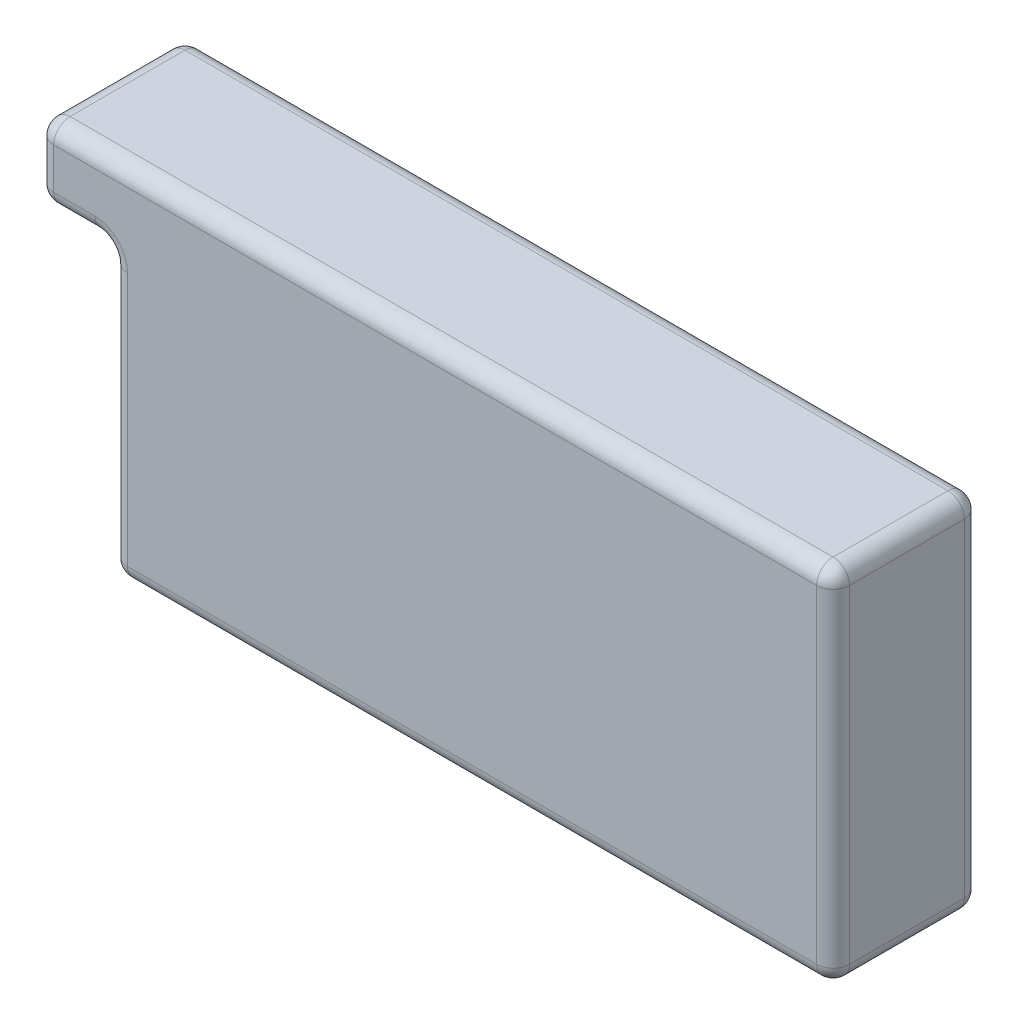
ISO-10303-21;
HEADER;
FILE_DESCRIPTION(('STEP AP214'),'2;1');
FILE_NAME('part.step','',(''),(''),'','','');
FILE_SCHEMA(('AUTOMOTIVE_DESIGN { 1 0 10303 214 1 1 1 1 }'));
ENDSEC;
DATA;
#1=APPLICATION_CONTEXT('core data for automotive mechanical design processes');
#2=APPLICATION_PROTOCOL_DEFINITION('international standard','automotive_design',2000,#1);
#3=PRODUCT_CONTEXT('',#1,'mechanical');
#4=PRODUCT('Part','Part','',(#3));
#5=PRODUCT_RELATED_PRODUCT_CATEGORY('part','',(#4));
#6=PRODUCT_DEFINITION_FORMATION('','',#4);
#7=PRODUCT_DEFINITION_CONTEXT('part definition',#1,'design');
#8=PRODUCT_DEFINITION('design','',#6,#7);
#9=PRODUCT_DEFINITION_SHAPE('','',#8);
#10=(LENGTH_UNIT() NAMED_UNIT(*) SI_UNIT(.MILLI.,.METRE.));
#11=(NAMED_UNIT(*) PLANE_ANGLE_UNIT() SI_UNIT($,.RADIAN.));
#12=(NAMED_UNIT(*) SI_UNIT($,.STERADIAN.) SOLID_ANGLE_UNIT());
#13=UNCERTAINTY_MEASURE_WITH_UNIT(LENGTH_MEASURE(1.E-05),#10,'distance_accuracy_value','');
#14=(GEOMETRIC_REPRESENTATION_CONTEXT(3) GLOBAL_UNCERTAINTY_ASSIGNED_CONTEXT((#13)) GLOBAL_UNIT_ASSIGNED_CONTEXT((#10,
#11,#12)) REPRESENTATION_CONTEXT('',''));
#15=CARTESIAN_POINT('',(0.,0.,0.));
#16=DIRECTION('',(0.,0.,1.));
#17=DIRECTION('',(1.,0.,0.));
#18=AXIS2_PLACEMENT_3D('',#15,#16,#17);
#19=CARTESIAN_POINT('',(0.,0.,9.));
#20=DIRECTION('',(1.,0.,0.));
#21=DIRECTION('',(0.,0.,-1.));
#22=AXIS2_PLACEMENT_3D('',#19,#20,#21);
#23=PLANE('',#22);
#24=DIRECTION('',(0.,-1.,0.));
#25=VECTOR('',#24,1.);
#26=CARTESIAN_POINT('',(0.,0.,0.999999999999999));
#27=LINE('',#26,#25);
#28=CARTESIAN_POINT('',(0.,-5.5,0.999999999999999));
#29=VERTEX_POINT('',#28);
#30=CARTESIAN_POINT('',(0.,-21.,0.999999999999999));
#31=VERTEX_POINT('',#30);
#32=EDGE_CURVE('E256',#29,#31,#27,.T.);
#33=ORIENTED_EDGE('',*,*,#32,.T.);
#34=DIRECTION('',(0.,0.,-1.));
#35=VECTOR('',#34,1.);
#36=CARTESIAN_POINT('',(0.,-21.,9.));
#37=LINE('',#36,#35);
#38=CARTESIAN_POINT('',(0.,-21.,8.));
#39=VERTEX_POINT('',#38);
#40=EDGE_CURVE('E258',#31,#39,#37,.F.);
#41=ORIENTED_EDGE('',*,*,#40,.T.);
#42=DIRECTION('',(0.,-1.,0.));
#43=VECTOR('',#42,1.);
#44=CARTESIAN_POINT('',(0.,-4.5,8.));
#45=LINE('',#44,#43);
#46=CARTESIAN_POINT('',(0.,-5.5,8.));
#47=VERTEX_POINT('',#46);
#48=EDGE_CURVE('E252',#39,#47,#45,.F.);
#49=ORIENTED_EDGE('',*,*,#48,.T.);
#50=DIRECTION('',(0.,0.,-1.));
#51=VECTOR('',#50,1.);
#52=CARTESIAN_POINT('',(0.,-5.5,9.));
#53=LINE('',#52,#51);
#54=EDGE_CURVE('E254',#47,#29,#53,.T.);
#55=ORIENTED_EDGE('',*,*,#54,.T.);
#56=EDGE_LOOP('',(#33,#41,#49,#55));
#57=FACE_BOUND('',#56,.T.);
#58=ADVANCED_FACE('F34',(#57),#23,.F.);
#59=CARTESIAN_POINT('',(0.,-22.,9.));
#60=DIRECTION('',(0.,1.,0.));
#61=DIRECTION('',(0.,0.,1.));
#62=AXIS2_PLACEMENT_3D('',#59,#60,#61);
#63=PLANE('',#62);
#64=DIRECTION('',(1.,0.,0.));
#65=VECTOR('',#64,1.);
#66=CARTESIAN_POINT('',(0.,-22.,0.999999999999999));
#67=LINE('',#66,#65);
#68=CARTESIAN_POINT('',(1.,-22.,0.999999999999999));
#69=VERTEX_POINT('',#68);
#70=CARTESIAN_POINT('',(43.,-22.,0.999999999999999));
#71=VERTEX_POINT('',#70);
#72=EDGE_CURVE('E222',#69,#71,#67,.T.);
#73=ORIENTED_EDGE('',*,*,#72,.T.);
#74=DIRECTION('',(0.,0.,-1.));
#75=VECTOR('',#74,1.);
#76=CARTESIAN_POINT('',(43.,-22.,9.));
#77=LINE('',#76,#75);
#78=CARTESIAN_POINT('',(43.,-22.,8.));
#79=VERTEX_POINT('',#78);
#80=EDGE_CURVE('E224',#71,#79,#77,.F.);
#81=ORIENTED_EDGE('',*,*,#80,.T.);
#82=DIRECTION('',(1.,0.,0.));
#83=VECTOR('',#82,1.);
#84=CARTESIAN_POINT('',(0.,-22.,8.));
#85=LINE('',#84,#83);
#86=CARTESIAN_POINT('',(1.,-22.,8.));
#87=VERTEX_POINT('',#86);
#88=EDGE_CURVE('E218',#79,#87,#85,.F.);
#89=ORIENTED_EDGE('',*,*,#88,.T.);
#90=DIRECTION('',(0.,0.,-1.));
#91=VECTOR('',#90,1.);
#92=CARTESIAN_POINT('',(1.,-22.,9.));
#93=LINE('',#92,#91);
#94=EDGE_CURVE('E220',#87,#69,#93,.T.);
#95=ORIENTED_EDGE('',*,*,#94,.T.);
#96=EDGE_LOOP('',(#73,#81,#89,#95));
#97=FACE_BOUND('',#96,.T.);
#98=ADVANCED_FACE('F419',(#97),#63,.F.);
#99=CARTESIAN_POINT('',(44.,0.,9.));
#100=DIRECTION('',(-1.,0.,0.));
#101=DIRECTION('',(0.,0.,1.));
#102=AXIS2_PLACEMENT_3D('',#99,#100,#101);
#103=PLANE('',#102);
#104=DIRECTION('',(0.,0.,-1.));
#105=VECTOR('',#104,1.);
#106=CARTESIAN_POINT('',(44.,-21.,9.));
#107=LINE('',#106,#105);
#108=CARTESIAN_POINT('',(44.,-21.,8.));
#109=VERTEX_POINT('',#108);
#110=CARTESIAN_POINT('',(44.,-21.,0.999999999999999));
#111=VERTEX_POINT('',#110);
#112=EDGE_CURVE('E213',#109,#111,#107,.T.);
#113=ORIENTED_EDGE('',*,*,#112,.T.);
#114=DIRECTION('',(0.,1.,0.));
#115=VECTOR('',#114,1.);
#116=CARTESIAN_POINT('',(44.,0.,0.999999999999999));
#117=LINE('',#116,#115);
#118=CARTESIAN_POINT('',(44.,-1.,0.999999999999999));
#119=VERTEX_POINT('',#118);
#120=EDGE_CURVE('E216',#111,#119,#117,.T.);
#121=ORIENTED_EDGE('',*,*,#120,.T.);
#122=DIRECTION('',(0.,0.,-1.));
#123=VECTOR('',#122,1.);
#124=CARTESIAN_POINT('',(44.,-1.,9.));
#125=LINE('',#124,#123);
#126=CARTESIAN_POINT('',(44.,-1.,8.));
#127=VERTEX_POINT('',#126);
#128=EDGE_CURVE('E211',#119,#127,#125,.F.);
#129=ORIENTED_EDGE('',*,*,#128,.T.);
#130=DIRECTION('',(0.,1.,0.));
#131=VECTOR('',#130,1.);
#132=CARTESIAN_POINT('',(44.,-22.,8.));
#133=LINE('',#132,#131);
#134=EDGE_CURVE('E209',#127,#109,#133,.F.);
#135=ORIENTED_EDGE('',*,*,#134,.T.);
#136=EDGE_LOOP('',(#113,#121,#129,#135));
#137=FACE_BOUND('',#136,.T.);
#138=ADVANCED_FACE('F391',(#137),#103,.F.);
#139=CARTESIAN_POINT('',(0.,0.,9.));
#140=DIRECTION('',(0.,-1.,0.));
#141=DIRECTION('',(0.,0.,-1.));
#142=AXIS2_PLACEMENT_3D('',#139,#140,#141);
#143=PLANE('',#142);
#144=DIRECTION('',(0.,0.,-1.));
#145=VECTOR('',#144,1.);
#146=CARTESIAN_POINT('',(43.,0.,9.));
#147=LINE('',#146,#145);
#148=CARTESIAN_POINT('',(43.,0.,8.));
#149=VERTEX_POINT('',#148);
#150=CARTESIAN_POINT('',(43.,0.,0.999999999999999));
#151=VERTEX_POINT('',#150);
#152=EDGE_CURVE('E231',#149,#151,#147,.T.);
#153=ORIENTED_EDGE('',*,*,#152,.T.);
#154=DIRECTION('',(-1.,0.,0.));
#155=VECTOR('',#154,1.);
#156=CARTESIAN_POINT('',(0.,0.,0.999999999999999));
#157=LINE('',#156,#155);
#158=CARTESIAN_POINT('',(-3.5,0.,0.999999999999999));
#159=VERTEX_POINT('',#158);
#160=EDGE_CURVE('E234',#151,#159,#157,.T.);
#161=ORIENTED_EDGE('',*,*,#160,.T.);
#162=DIRECTION('',(0.,0.,-1.));
#163=VECTOR('',#162,1.);
#164=CARTESIAN_POINT('',(-3.5,0.,9.));
#165=LINE('',#164,#163);
#166=CARTESIAN_POINT('',(-3.5,0.,8.));
#167=VERTEX_POINT('',#166);
#168=EDGE_CURVE('E229',#159,#167,#165,.F.);
#169=ORIENTED_EDGE('',*,*,#168,.T.);
#170=DIRECTION('',(-1.,0.,0.));
#171=VECTOR('',#170,1.);
#172=CARTESIAN_POINT('',(44.,0.,8.));
#173=LINE('',#172,#171);
#174=EDGE_CURVE('E227',#167,#149,#173,.F.);
#175=ORIENTED_EDGE('',*,*,#174,.T.);
#176=EDGE_LOOP('',(#153,#161,#169,#175));
#177=FACE_BOUND('',#176,.T.);
#178=ADVANCED_FACE('F726',(#177),#143,.F.);
#179=CARTESIAN_POINT('',(0.,0.,9.));
#180=DIRECTION('',(0.,0.,1.));
#181=DIRECTION('',(1.,0.,0.));
#182=AXIS2_PLACEMENT_3D('',#179,#180,#181);
#183=PLANE('',#182);
#184=DIRECTION('',(0.,-1.,0.));
#185=VECTOR('',#184,1.);
#186=CARTESIAN_POINT('',(1.,-22.,9.));
#187=LINE('',#186,#185);
#188=CARTESIAN_POINT('',(1.,-5.5,9.));
#189=VERTEX_POINT('',#188);
#190=CARTESIAN_POINT('',(1.,-21.,9.));
#191=VERTEX_POINT('',#190);
#192=EDGE_CURVE('E43',#189,#191,#187,.T.);
#193=ORIENTED_EDGE('',*,*,#192,.T.);
#194=DIRECTION('',(1.,0.,0.));
#195=VECTOR('',#194,1.);
#196=CARTESIAN_POINT('',(44.,-21.,9.));
#197=LINE('',#196,#195);
#198=CARTESIAN_POINT('',(43.,-21.,9.));
#199=VERTEX_POINT('',#198);
#200=EDGE_CURVE('E11',#191,#199,#197,.T.);
#201=ORIENTED_EDGE('',*,*,#200,.T.);
#202=DIRECTION('',(0.,1.,0.));
#203=VECTOR('',#202,1.);
#204=CARTESIAN_POINT('',(43.,0.,9.));
#205=LINE('',#204,#203);
#206=CARTESIAN_POINT('',(43.,-1.,9.));
#207=VERTEX_POINT('',#206);
#208=EDGE_CURVE('E267',#199,#207,#205,.T.);
#209=ORIENTED_EDGE('',*,*,#208,.T.);
#210=DIRECTION('',(-1.,0.,0.));
#211=VECTOR('',#210,1.);
#212=CARTESIAN_POINT('',(-4.5,-1.,9.));
#213=LINE('',#212,#211);
#214=CARTESIAN_POINT('',(-3.5,-1.,9.));
#215=VERTEX_POINT('',#214);
#216=EDGE_CURVE('E261',#207,#215,#213,.T.);
#217=ORIENTED_EDGE('',*,*,#216,.T.);
#218=DIRECTION('',(0.,1.,0.));
#219=VECTOR('',#218,1.);
#220=CARTESIAN_POINT('',(-3.5,0.,9.));
#221=LINE('',#220,#219);
#222=CARTESIAN_POINT('',(-3.5,-3.5,9.));
#223=VERTEX_POINT('',#222);
#224=EDGE_CURVE('E263',#215,#223,#221,.F.);
#225=ORIENTED_EDGE('',*,*,#224,.T.);
#226=DIRECTION('',(-1.,0.,0.));
#227=VECTOR('',#226,1.);
#228=CARTESIAN_POINT('',(0.,-3.5,9.));
#229=LINE('',#228,#227);
#230=CARTESIAN_POINT('',(-1.,-3.5,9.));
#231=VERTEX_POINT('',#230);
#232=EDGE_CURVE('E265',#223,#231,#229,.F.);
#233=ORIENTED_EDGE('',*,*,#232,.T.);
#234=CARTESIAN_POINT('',(-1.,-5.5,9.));
#235=DIRECTION('',(0.,0.,1.));
#236=DIRECTION('',(1.,0.,0.));
#237=AXIS2_PLACEMENT_3D('',#234,#235,#236);
#238=CIRCLE('',#237,2.);
#239=EDGE_CURVE('E54',#189,#231,#238,.T.);
#240=ORIENTED_EDGE('',*,*,#239,.F.);
#241=EDGE_LOOP('',(#193,#201,#209,#217,#225,#233,#240));
#242=FACE_BOUND('',#241,.T.);
#243=ADVANCED_FACE('F405',(#242),#183,.T.);
#244=CARTESIAN_POINT('',(0.,0.,0.));
#245=DIRECTION('',(0.,0.,1.));
#246=DIRECTION('',(1.,0.,0.));
#247=AXIS2_PLACEMENT_3D('',#244,#245,#246);
#248=PLANE('',#247);
#249=DIRECTION('',(0.,1.,0.));
#250=VECTOR('',#249,1.);
#251=CARTESIAN_POINT('',(43.,0.,0.));
#252=LINE('',#251,#250);
#253=CARTESIAN_POINT('',(43.,-1.,0.));
#254=VERTEX_POINT('',#253);
#255=CARTESIAN_POINT('',(43.,-21.,0.));
#256=VERTEX_POINT('',#255);
#257=EDGE_CURVE('E247',#254,#256,#252,.F.);
#258=ORIENTED_EDGE('',*,*,#257,.T.);
#259=DIRECTION('',(1.,0.,0.));
#260=VECTOR('',#259,1.);
#261=CARTESIAN_POINT('',(0.,-21.,0.));
#262=LINE('',#261,#260);
#263=CARTESIAN_POINT('',(1.,-21.,0.));
#264=VERTEX_POINT('',#263);
#265=EDGE_CURVE('E249',#256,#264,#262,.F.);
#266=ORIENTED_EDGE('',*,*,#265,.T.);
#267=DIRECTION('',(0.,-1.,0.));
#268=VECTOR('',#267,1.);
#269=CARTESIAN_POINT('',(1.,0.,0.));
#270=LINE('',#269,#268);
#271=CARTESIAN_POINT('',(1.,-5.5,0.));
#272=VERTEX_POINT('',#271);
#273=EDGE_CURVE('E239',#264,#272,#270,.F.);
#274=ORIENTED_EDGE('',*,*,#273,.T.);
#275=CARTESIAN_POINT('',(-1.,-5.5,0.));
#276=DIRECTION('',(0.,0.,1.));
#277=DIRECTION('',(1.,0.,0.));
#278=AXIS2_PLACEMENT_3D('',#275,#276,#277);
#279=CIRCLE('',#278,2.);
#280=CARTESIAN_POINT('',(-1.,-3.5,0.));
#281=VERTEX_POINT('',#280);
#282=EDGE_CURVE('E236',#281,#272,#279,.F.);
#283=ORIENTED_EDGE('',*,*,#282,.F.);
#284=DIRECTION('',(-1.,0.,0.));
#285=VECTOR('',#284,1.);
#286=CARTESIAN_POINT('',(-4.5,-3.5,0.));
#287=LINE('',#286,#285);
#288=CARTESIAN_POINT('',(-3.5,-3.5,0.));
#289=VERTEX_POINT('',#288);
#290=EDGE_CURVE('E241',#281,#289,#287,.T.);
#291=ORIENTED_EDGE('',*,*,#290,.T.);
#292=DIRECTION('',(0.,-1.,0.));
#293=VECTOR('',#292,1.);
#294=CARTESIAN_POINT('',(-3.5,0.,0.));
#295=LINE('',#294,#293);
#296=CARTESIAN_POINT('',(-3.5,-1.,0.));
#297=VERTEX_POINT('',#296);
#298=EDGE_CURVE('E243',#289,#297,#295,.F.);
#299=ORIENTED_EDGE('',*,*,#298,.T.);
#300=DIRECTION('',(-1.,0.,0.));
#301=VECTOR('',#300,1.);
#302=CARTESIAN_POINT('',(0.,-1.,0.));
#303=LINE('',#302,#301);
#304=EDGE_CURVE('E245',#297,#254,#303,.F.);
#305=ORIENTED_EDGE('',*,*,#304,.T.);
#306=EDGE_LOOP('',(#258,#266,#274,#283,#291,#299,#305));
#307=FACE_BOUND('',#306,.T.);
#308=ADVANCED_FACE('F382',(#307),#248,.F.);
#309=CARTESIAN_POINT('',(9.,-4.5,9.));
#310=DIRECTION('',(0.,-1.,0.));
#311=DIRECTION('',(0.,0.,-1.));
#312=AXIS2_PLACEMENT_3D('',#309,#310,#311);
#313=PLANE('',#312);
#314=DIRECTION('',(-1.,0.,0.));
#315=VECTOR('',#314,1.);
#316=CARTESIAN_POINT('',(9.,-4.5,8.));
#317=LINE('',#316,#315);
#318=CARTESIAN_POINT('',(-1.,-4.5,8.));
#319=VERTEX_POINT('',#318);
#320=CARTESIAN_POINT('',(-3.5,-4.5,8.));
#321=VERTEX_POINT('',#320);
#322=EDGE_CURVE('E199',#319,#321,#317,.T.);
#323=ORIENTED_EDGE('',*,*,#322,.T.);
#324=DIRECTION('',(0.,0.,1.));
#325=VECTOR('',#324,1.);
#326=CARTESIAN_POINT('',(-3.5,-4.5,9.));
#327=LINE('',#326,#325);
#328=CARTESIAN_POINT('',(-3.5,-4.5,1.));
#329=VERTEX_POINT('',#328);
#330=EDGE_CURVE('E170',#321,#329,#327,.F.);
#331=ORIENTED_EDGE('',*,*,#330,.T.);
#332=DIRECTION('',(-1.,0.,0.));
#333=VECTOR('',#332,1.);
#334=CARTESIAN_POINT('',(0.,-4.5,1.));
#335=LINE('',#334,#333);
#336=CARTESIAN_POINT('',(-1.,-4.5,1.));
#337=VERTEX_POINT('',#336);
#338=EDGE_CURVE('E206',#329,#337,#335,.F.);
#339=ORIENTED_EDGE('',*,*,#338,.T.);
#340=DIRECTION('',(0.,0.,-1.));
#341=VECTOR('',#340,1.);
#342=CARTESIAN_POINT('',(-0.999999999999999,-4.5,9.));
#343=LINE('',#342,#341);
#344=EDGE_CURVE('E204',#337,#319,#343,.F.);
#345=ORIENTED_EDGE('',*,*,#344,.T.);
#346=EDGE_LOOP('',(#323,#331,#339,#345));
#347=FACE_BOUND('',#346,.T.);
#348=ADVANCED_FACE('F699',(#347),#313,.T.);
#349=CARTESIAN_POINT('',(-4.5,0.,0.));
#350=DIRECTION('',(-1.,0.,0.));
#351=DIRECTION('',(0.,0.,1.));
#352=AXIS2_PLACEMENT_3D('',#349,#350,#351);
#353=PLANE('',#352);
#354=DIRECTION('',(0.,0.,-1.));
#355=VECTOR('',#354,1.);
#356=CARTESIAN_POINT('',(-4.5,-1.,0.));
#357=LINE('',#356,#355);
#358=CARTESIAN_POINT('',(-4.5,-1.,8.));
#359=VERTEX_POINT('',#358);
#360=CARTESIAN_POINT('',(-4.5,-1.,1.));
#361=VERTEX_POINT('',#360);
#362=EDGE_CURVE('E192',#359,#361,#357,.T.);
#363=ORIENTED_EDGE('',*,*,#362,.T.);
#364=DIRECTION('',(0.,-1.,0.));
#365=VECTOR('',#364,1.);
#366=CARTESIAN_POINT('',(-4.5,-4.5,1.));
#367=LINE('',#366,#365);
#368=CARTESIAN_POINT('',(-4.5,-3.5,1.));
#369=VERTEX_POINT('',#368);
#370=EDGE_CURVE('E196',#361,#369,#367,.T.);
#371=ORIENTED_EDGE('',*,*,#370,.T.);
#372=DIRECTION('',(0.,0.,1.));
#373=VECTOR('',#372,1.);
#374=CARTESIAN_POINT('',(-4.5,-3.5,0.));
#375=LINE('',#374,#373);
#376=CARTESIAN_POINT('',(-4.5,-3.5,8.));
#377=VERTEX_POINT('',#376);
#378=EDGE_CURVE('E168',#369,#377,#375,.T.);
#379=ORIENTED_EDGE('',*,*,#378,.T.);
#380=DIRECTION('',(0.,1.,0.));
#381=VECTOR('',#380,1.);
#382=CARTESIAN_POINT('',(-4.5,0.,8.));
#383=LINE('',#382,#381);
#384=EDGE_CURVE('E186',#377,#359,#383,.T.);
#385=ORIENTED_EDGE('',*,*,#384,.T.);
#386=EDGE_LOOP('',(#363,#371,#379,#385));
#387=FACE_BOUND('',#386,.T.);
#388=ADVANCED_FACE('F194',(#387),#353,.T.);
#389=CARTESIAN_POINT('',(43.,-21.,9.));
#390=DIRECTION('',(0.,0.,-1.));
#391=DIRECTION('',(-1.,0.,0.));
#392=AXIS2_PLACEMENT_3D('',#389,#390,#391);
#393=CYLINDRICAL_SURFACE('',#392,1.);
#394=CARTESIAN_POINT('',(43.,-21.,0.999999999999999));
#395=DIRECTION('',(0.,0.,-1.));
#396=DIRECTION('',(-1.,0.,0.));
#397=AXIS2_PLACEMENT_3D('',#394,#395,#396);
#398=CIRCLE('',#397,1.);
#399=EDGE_CURVE('E38',#111,#71,#398,.T.);
#400=ORIENTED_EDGE('',*,*,#399,.F.);
#401=ORIENTED_EDGE('',*,*,#112,.F.);
#402=CARTESIAN_POINT('',(43.,-21.,8.));
#403=DIRECTION('',(0.,0.,1.));
#404=DIRECTION('',(1.,0.,0.));
#405=AXIS2_PLACEMENT_3D('',#402,#403,#404);
#406=CIRCLE('',#405,1.);
#407=EDGE_CURVE('E360',#79,#109,#406,.T.);
#408=ORIENTED_EDGE('',*,*,#407,.F.);
#409=ORIENTED_EDGE('',*,*,#80,.F.);
#410=EDGE_LOOP('',(#400,#401,#408,#409));
#411=FACE_BOUND('',#410,.T.);
#412=ADVANCED_FACE('F36',(#411),#393,.T.);
#413=CARTESIAN_POINT('',(43.,-21.,1.));
#414=DIRECTION('',(0.,0.,1.));
#415=DIRECTION('',(1.,0.,0.));
#416=AXIS2_PLACEMENT_3D('',#413,#414,#415);
#417=SPHERICAL_SURFACE('',#416,1.);
#418=CARTESIAN_POINT('',(43.,-21.,1.));
#419=DIRECTION('',(0.,-1.,0.));
#420=DIRECTION('',(0.,0.,-1.));
#421=AXIS2_PLACEMENT_3D('',#418,#419,#420);
#422=CIRCLE('',#421,1.);
#423=EDGE_CURVE('E355',#111,#256,#422,.F.);
#424=ORIENTED_EDGE('',*,*,#423,.F.);
#425=ORIENTED_EDGE('',*,*,#399,.T.);
#426=CARTESIAN_POINT('',(43.,-21.,0.999999999999999));
#427=DIRECTION('',(1.,0.,0.));
#428=DIRECTION('',(0.,0.,-1.));
#429=AXIS2_PLACEMENT_3D('',#426,#427,#428);
#430=CIRCLE('',#429,1.);
#431=EDGE_CURVE('E358',#256,#71,#430,.F.);
#432=ORIENTED_EDGE('',*,*,#431,.F.);
#433=EDGE_LOOP('',(#424,#425,#432));
#434=FACE_BOUND('',#433,.T.);
#435=ADVANCED_FACE('F371',(#434),#417,.T.);
#436=CARTESIAN_POINT('',(43.,-21.,8.));
#437=DIRECTION('',(0.,0.,1.));
#438=DIRECTION('',(1.,0.,0.));
#439=AXIS2_PLACEMENT_3D('',#436,#437,#438);
#440=SPHERICAL_SURFACE('',#439,1.);
#441=CARTESIAN_POINT('',(43.,-21.,8.));
#442=DIRECTION('',(1.,0.,0.));
#443=DIRECTION('',(0.,0.,-1.));
#444=AXIS2_PLACEMENT_3D('',#441,#442,#443);
#445=CIRCLE('',#444,1.);
#446=EDGE_CURVE('E349',#79,#199,#445,.F.);
#447=ORIENTED_EDGE('',*,*,#446,.F.);
#448=ORIENTED_EDGE('',*,*,#407,.T.);
#449=CARTESIAN_POINT('',(43.,-21.,8.));
#450=DIRECTION('',(0.,-1.,0.));
#451=DIRECTION('',(0.,0.,-1.));
#452=AXIS2_PLACEMENT_3D('',#449,#450,#451);
#453=CIRCLE('',#452,1.);
#454=EDGE_CURVE('E352',#199,#109,#453,.F.);
#455=ORIENTED_EDGE('',*,*,#454,.F.);
#456=EDGE_LOOP('',(#447,#448,#455));
#457=FACE_BOUND('',#456,.T.);
#458=ADVANCED_FACE('F410',(#457),#440,.T.);
#459=CARTESIAN_POINT('',(0.,-21.,0.999999999999999));
#460=DIRECTION('',(1.,0.,0.));
#461=DIRECTION('',(0.,0.,-1.));
#462=AXIS2_PLACEMENT_3D('',#459,#460,#461);
#463=CYLINDRICAL_SURFACE('',#462,1.);
#464=ORIENTED_EDGE('',*,*,#431,.T.);
#465=ORIENTED_EDGE('',*,*,#72,.F.);
#466=CARTESIAN_POINT('',(1.,-21.,1.));
#467=DIRECTION('',(-1.,0.,0.));
#468=DIRECTION('',(0.,0.,1.));
#469=AXIS2_PLACEMENT_3D('',#466,#467,#468);
#470=CIRCLE('',#469,1.);
#471=EDGE_CURVE('E343',#264,#69,#470,.T.);
#472=ORIENTED_EDGE('',*,*,#471,.F.);
#473=ORIENTED_EDGE('',*,*,#265,.F.);
#474=EDGE_LOOP('',(#464,#465,#472,#473));
#475=FACE_BOUND('',#474,.T.);
#476=ADVANCED_FACE('F378',(#475),#463,.T.);
#477=CARTESIAN_POINT('',(43.,0.,0.999999999999999));
#478=DIRECTION('',(0.,1.,0.));
#479=DIRECTION('',(0.,0.,1.));
#480=AXIS2_PLACEMENT_3D('',#477,#478,#479);
#481=CYLINDRICAL_SURFACE('',#480,1.);
#482=ORIENTED_EDGE('',*,*,#423,.T.);
#483=ORIENTED_EDGE('',*,*,#257,.F.);
#484=CARTESIAN_POINT('',(43.,-1.,0.999999999999999));
#485=DIRECTION('',(0.,1.,0.));
#486=DIRECTION('',(0.,0.,1.));
#487=AXIS2_PLACEMENT_3D('',#484,#485,#486);
#488=CIRCLE('',#487,1.);
#489=EDGE_CURVE('E340',#119,#254,#488,.T.);
#490=ORIENTED_EDGE('',*,*,#489,.F.);
#491=ORIENTED_EDGE('',*,*,#120,.F.);
#492=EDGE_LOOP('',(#482,#483,#490,#491));
#493=FACE_BOUND('',#492,.T.);
#494=ADVANCED_FACE('F388',(#493),#481,.T.);
#495=CARTESIAN_POINT('',(43.,-1.,9.));
#496=DIRECTION('',(0.,0.,-1.));
#497=DIRECTION('',(-1.,0.,0.));
#498=AXIS2_PLACEMENT_3D('',#495,#496,#497);
#499=CYLINDRICAL_SURFACE('',#498,1.);
#500=CARTESIAN_POINT('',(43.,-1.,8.));
#501=DIRECTION('',(0.,0.,1.));
#502=DIRECTION('',(1.,0.,0.));
#503=AXIS2_PLACEMENT_3D('',#500,#501,#502);
#504=CIRCLE('',#503,1.);
#505=EDGE_CURVE('E334',#127,#149,#504,.T.);
#506=ORIENTED_EDGE('',*,*,#505,.F.);
#507=ORIENTED_EDGE('',*,*,#128,.F.);
#508=CARTESIAN_POINT('',(43.,-1.,0.999999999999999));
#509=DIRECTION('',(0.,0.,-1.));
#510=DIRECTION('',(-1.,0.,0.));
#511=AXIS2_PLACEMENT_3D('',#508,#509,#510);
#512=CIRCLE('',#511,1.);
#513=EDGE_CURVE('E337',#151,#119,#512,.T.);
#514=ORIENTED_EDGE('',*,*,#513,.F.);
#515=ORIENTED_EDGE('',*,*,#152,.F.);
#516=EDGE_LOOP('',(#506,#507,#514,#515));
#517=FACE_BOUND('',#516,.T.);
#518=ADVANCED_FACE('F396',(#517),#499,.T.);
#519=CARTESIAN_POINT('',(43.,0.,8.));
#520=DIRECTION('',(0.,-1.,0.));
#521=DIRECTION('',(0.,0.,-1.));
#522=AXIS2_PLACEMENT_3D('',#519,#520,#521);
#523=CYLINDRICAL_SURFACE('',#522,1.);
#524=ORIENTED_EDGE('',*,*,#454,.T.);
#525=ORIENTED_EDGE('',*,*,#134,.F.);
#526=CARTESIAN_POINT('',(43.,-1.,8.));
#527=DIRECTION('',(0.,1.,0.));
#528=DIRECTION('',(0.,0.,1.));
#529=AXIS2_PLACEMENT_3D('',#526,#527,#528);
#530=CIRCLE('',#529,1.);
#531=EDGE_CURVE('E331',#207,#127,#530,.T.);
#532=ORIENTED_EDGE('',*,*,#531,.F.);
#533=ORIENTED_EDGE('',*,*,#208,.F.);
#534=EDGE_LOOP('',(#524,#525,#532,#533));
#535=FACE_BOUND('',#534,.T.);
#536=ADVANCED_FACE('F404',(#535),#523,.T.);
#537=CARTESIAN_POINT('',(0.,-21.,8.));
#538=DIRECTION('',(-1.,0.,0.));
#539=DIRECTION('',(0.,0.,1.));
#540=AXIS2_PLACEMENT_3D('',#537,#538,#539);
#541=CYLINDRICAL_SURFACE('',#540,1.);
#542=ORIENTED_EDGE('',*,*,#446,.T.);
#543=ORIENTED_EDGE('',*,*,#200,.F.);
#544=CARTESIAN_POINT('',(1.,-21.,8.));
#545=DIRECTION('',(-1.,0.,0.));
#546=DIRECTION('',(0.,0.,1.));
#547=AXIS2_PLACEMENT_3D('',#544,#545,#546);
#548=CIRCLE('',#547,1.);
#549=EDGE_CURVE('E328',#87,#191,#548,.T.);
#550=ORIENTED_EDGE('',*,*,#549,.F.);
#551=ORIENTED_EDGE('',*,*,#88,.F.);
#552=EDGE_LOOP('',(#542,#543,#550,#551));
#553=FACE_BOUND('',#552,.T.);
#554=ADVANCED_FACE('F409',(#553),#541,.T.);
#555=CARTESIAN_POINT('',(1.,-21.,9.));
#556=DIRECTION('',(0.,0.,-1.));
#557=DIRECTION('',(-1.,0.,0.));
#558=AXIS2_PLACEMENT_3D('',#555,#556,#557);
#559=CYLINDRICAL_SURFACE('',#558,1.);
#560=CARTESIAN_POINT('',(1.,-21.,0.999999999999999));
#561=DIRECTION('',(0.,0.,-1.));
#562=DIRECTION('',(-1.,0.,0.));
#563=AXIS2_PLACEMENT_3D('',#560,#561,#562);
#564=CIRCLE('',#563,1.);
#565=EDGE_CURVE('E346',#69,#31,#564,.T.);
#566=ORIENTED_EDGE('',*,*,#565,.F.);
#567=ORIENTED_EDGE('',*,*,#94,.F.);
#568=CARTESIAN_POINT('',(1.,-21.,8.));
#569=DIRECTION('',(0.,0.,1.));
#570=DIRECTION('',(1.,0.,0.));
#571=AXIS2_PLACEMENT_3D('',#568,#569,#570);
#572=CIRCLE('',#571,1.);
#573=EDGE_CURVE('E325',#39,#87,#572,.T.);
#574=ORIENTED_EDGE('',*,*,#573,.F.);
#575=ORIENTED_EDGE('',*,*,#40,.F.);
#576=EDGE_LOOP('',(#566,#567,#574,#575));
#577=FACE_BOUND('',#576,.T.);
#578=ADVANCED_FACE('F504',(#577),#559,.T.);
#579=CARTESIAN_POINT('',(1.,-21.,1.));
#580=DIRECTION('',(0.,0.,1.));
#581=DIRECTION('',(1.,0.,0.));
#582=AXIS2_PLACEMENT_3D('',#579,#580,#581);
#583=SPHERICAL_SURFACE('',#582,1.);
#584=ORIENTED_EDGE('',*,*,#471,.T.);
#585=ORIENTED_EDGE('',*,*,#565,.T.);
#586=CARTESIAN_POINT('',(1.,-21.,0.999999999999999));
#587=DIRECTION('',(0.,-1.,0.));
#588=DIRECTION('',(0.,0.,-1.));
#589=AXIS2_PLACEMENT_3D('',#586,#587,#588);
#590=CIRCLE('',#589,1.);
#591=EDGE_CURVE('E322',#264,#31,#590,.F.);
#592=ORIENTED_EDGE('',*,*,#591,.F.);
#593=EDGE_LOOP('',(#584,#585,#592));
#594=FACE_BOUND('',#593,.T.);
#595=ADVANCED_FACE('F500',(#594),#583,.T.);
#596=CARTESIAN_POINT('',(43.,-1.,1.));
#597=DIRECTION('',(0.,0.,1.));
#598=DIRECTION('',(1.,0.,0.));
#599=AXIS2_PLACEMENT_3D('',#596,#597,#598);
#600=SPHERICAL_SURFACE('',#599,1.);
#601=ORIENTED_EDGE('',*,*,#513,.T.);
#602=ORIENTED_EDGE('',*,*,#489,.T.);
#603=CARTESIAN_POINT('',(43.,-1.,1.));
#604=DIRECTION('',(1.,0.,0.));
#605=DIRECTION('',(0.,0.,-1.));
#606=AXIS2_PLACEMENT_3D('',#603,#604,#605);
#607=CIRCLE('',#606,1.);
#608=EDGE_CURVE('E319',#151,#254,#607,.F.);
#609=ORIENTED_EDGE('',*,*,#608,.F.);
#610=EDGE_LOOP('',(#601,#602,#609));
#611=FACE_BOUND('',#610,.T.);
#612=ADVANCED_FACE('F497',(#611),#600,.T.);
#613=CARTESIAN_POINT('',(43.,-1.,8.));
#614=DIRECTION('',(0.,0.,1.));
#615=DIRECTION('',(1.,0.,0.));
#616=AXIS2_PLACEMENT_3D('',#613,#614,#615);
#617=SPHERICAL_SURFACE('',#616,1.);
#618=ORIENTED_EDGE('',*,*,#531,.T.);
#619=ORIENTED_EDGE('',*,*,#505,.T.);
#620=CARTESIAN_POINT('',(43.,-1.,8.));
#621=DIRECTION('',(1.,0.,0.));
#622=DIRECTION('',(0.,0.,-1.));
#623=AXIS2_PLACEMENT_3D('',#620,#621,#622);
#624=CIRCLE('',#623,1.);
#625=EDGE_CURVE('E316',#207,#149,#624,.F.);
#626=ORIENTED_EDGE('',*,*,#625,.F.);
#627=EDGE_LOOP('',(#618,#619,#626));
#628=FACE_BOUND('',#627,.T.);
#629=ADVANCED_FACE('F401',(#628),#617,.T.);
#630=CARTESIAN_POINT('',(1.,-21.,8.));
#631=DIRECTION('',(0.,0.,1.));
#632=DIRECTION('',(1.,0.,0.));
#633=AXIS2_PLACEMENT_3D('',#630,#631,#632);
#634=SPHERICAL_SURFACE('',#633,1.);
#635=ORIENTED_EDGE('',*,*,#573,.T.);
#636=ORIENTED_EDGE('',*,*,#549,.T.);
#637=CARTESIAN_POINT('',(1.,-21.,8.));
#638=DIRECTION('',(0.,-1.,0.));
#639=DIRECTION('',(0.,0.,-1.));
#640=AXIS2_PLACEMENT_3D('',#637,#638,#639);
#641=CIRCLE('',#640,1.);
#642=EDGE_CURVE('E313',#39,#191,#641,.F.);
#643=ORIENTED_EDGE('',*,*,#642,.F.);
#644=EDGE_LOOP('',(#635,#636,#643));
#645=FACE_BOUND('',#644,.T.);
#646=ADVANCED_FACE('F490',(#645),#634,.T.);
#647=CARTESIAN_POINT('',(1.,0.,0.999999999999999));
#648=DIRECTION('',(0.,-1.,0.));
#649=DIRECTION('',(0.,0.,-1.));
#650=AXIS2_PLACEMENT_3D('',#647,#648,#649);
#651=CYLINDRICAL_SURFACE('',#650,1.);
#652=ORIENTED_EDGE('',*,*,#591,.T.);
#653=ORIENTED_EDGE('',*,*,#32,.F.);
#654=CARTESIAN_POINT('',(1.,-5.5,1.));
#655=DIRECTION('',(0.,1.,0.));
#656=DIRECTION('',(0.,0.,1.));
#657=AXIS2_PLACEMENT_3D('',#654,#655,#656);
#658=CIRCLE('',#657,1.);
#659=EDGE_CURVE('E307',#272,#29,#658,.T.);
#660=ORIENTED_EDGE('',*,*,#659,.F.);
#661=ORIENTED_EDGE('',*,*,#273,.F.);
#662=EDGE_LOOP('',(#652,#653,#660,#661));
#663=FACE_BOUND('',#662,.T.);
#664=ADVANCED_FACE('F486',(#663),#651,.T.);
#665=CARTESIAN_POINT('',(0.,-1.,0.999999999999999));
#666=DIRECTION('',(-1.,0.,0.));
#667=DIRECTION('',(0.,0.,1.));
#668=AXIS2_PLACEMENT_3D('',#665,#666,#667);
#669=CYLINDRICAL_SURFACE('',#668,1.);
#670=ORIENTED_EDGE('',*,*,#608,.T.);
#671=ORIENTED_EDGE('',*,*,#304,.F.);
#672=CARTESIAN_POINT('',(-3.5,-1.,0.999999999999999));
#673=DIRECTION('',(-1.,0.,0.));
#674=DIRECTION('',(0.,0.,1.));
#675=AXIS2_PLACEMENT_3D('',#672,#673,#674);
#676=CIRCLE('',#675,1.);
#677=EDGE_CURVE('E304',#159,#297,#676,.T.);
#678=ORIENTED_EDGE('',*,*,#677,.F.);
#679=ORIENTED_EDGE('',*,*,#160,.F.);
#680=EDGE_LOOP('',(#670,#671,#678,#679));
#681=FACE_BOUND('',#680,.T.);
#682=ADVANCED_FACE('F482',(#681),#669,.T.);
#683=CARTESIAN_POINT('',(-3.5,-1.,0.));
#684=DIRECTION('',(0.,0.,1.));
#685=DIRECTION('',(1.,0.,0.));
#686=AXIS2_PLACEMENT_3D('',#683,#684,#685);
#687=CYLINDRICAL_SURFACE('',#686,1.);
#688=CARTESIAN_POINT('',(-3.5,-1.,8.));
#689=DIRECTION('',(0.,0.,1.));
#690=DIRECTION('',(1.,0.,0.));
#691=AXIS2_PLACEMENT_3D('',#688,#689,#690);
#692=CIRCLE('',#691,1.);
#693=EDGE_CURVE('E298',#167,#359,#692,.T.);
#694=ORIENTED_EDGE('',*,*,#693,.F.);
#695=ORIENTED_EDGE('',*,*,#168,.F.);
#696=CARTESIAN_POINT('',(-3.5,-1.,1.));
#697=DIRECTION('',(0.,0.,-1.));
#698=DIRECTION('',(0.,1.,0.));
#699=AXIS2_PLACEMENT_3D('',#696,#697,#698);
#700=CIRCLE('',#699,1.);
#701=EDGE_CURVE('E301',#361,#159,#700,.T.);
#702=ORIENTED_EDGE('',*,*,#701,.F.);
#703=ORIENTED_EDGE('',*,*,#362,.F.);
#704=EDGE_LOOP('',(#694,#695,#702,#703));
#705=FACE_BOUND('',#704,.T.);
#706=ADVANCED_FACE('F478',(#705),#687,.T.);
#707=CARTESIAN_POINT('',(0.,-1.,8.));
#708=DIRECTION('',(1.,0.,0.));
#709=DIRECTION('',(0.,0.,-1.));
#710=AXIS2_PLACEMENT_3D('',#707,#708,#709);
#711=CYLINDRICAL_SURFACE('',#710,1.);
#712=ORIENTED_EDGE('',*,*,#625,.T.);
#713=ORIENTED_EDGE('',*,*,#174,.F.);
#714=CARTESIAN_POINT('',(-3.5,-1.,8.));
#715=DIRECTION('',(-1.,0.,0.));
#716=DIRECTION('',(0.,0.,1.));
#717=AXIS2_PLACEMENT_3D('',#714,#715,#716);
#718=CIRCLE('',#717,1.);
#719=EDGE_CURVE('E295',#215,#167,#718,.T.);
#720=ORIENTED_EDGE('',*,*,#719,.F.);
#721=ORIENTED_EDGE('',*,*,#216,.F.);
#722=EDGE_LOOP('',(#712,#713,#720,#721));
#723=FACE_BOUND('',#722,.T.);
#724=ADVANCED_FACE('F474',(#723),#711,.T.);
#725=CARTESIAN_POINT('',(1.,0.,8.));
#726=DIRECTION('',(0.,1.,0.));
#727=DIRECTION('',(0.,0.,1.));
#728=AXIS2_PLACEMENT_3D('',#725,#726,#727);
#729=CYLINDRICAL_SURFACE('',#728,1.);
#730=ORIENTED_EDGE('',*,*,#642,.T.);
#731=ORIENTED_EDGE('',*,*,#192,.F.);
#732=CARTESIAN_POINT('',(1.,-5.5,8.));
#733=DIRECTION('',(0.,1.,0.));
#734=DIRECTION('',(0.,0.,1.));
#735=AXIS2_PLACEMENT_3D('',#732,#733,#734);
#736=CIRCLE('',#735,1.);
#737=EDGE_CURVE('E292',#47,#189,#736,.T.);
#738=ORIENTED_EDGE('',*,*,#737,.F.);
#739=ORIENTED_EDGE('',*,*,#48,.F.);
#740=EDGE_LOOP('',(#730,#731,#738,#739));
#741=FACE_BOUND('',#740,.T.);
#742=ADVANCED_FACE('F470',(#741),#729,.T.);
#743=CARTESIAN_POINT('',(-1.,-5.5,9.));
#744=DIRECTION('',(0.,0.,-1.));
#745=DIRECTION('',(0.,1.,0.));
#746=AXIS2_PLACEMENT_3D('',#743,#744,#745);
#747=CYLINDRICAL_SURFACE('',#746,1.);
#748=CARTESIAN_POINT('',(-1.,-5.5,1.));
#749=DIRECTION('',(0.,0.,1.));
#750=DIRECTION('',(1.,0.,0.));
#751=AXIS2_PLACEMENT_3D('',#748,#749,#750);
#752=CIRCLE('',#751,1.);
#753=EDGE_CURVE('E310',#29,#337,#752,.T.);
#754=ORIENTED_EDGE('',*,*,#753,.F.);
#755=ORIENTED_EDGE('',*,*,#54,.F.);
#756=CARTESIAN_POINT('',(-1.,-5.5,8.));
#757=DIRECTION('',(0.,0.,1.));
#758=DIRECTION('',(1.,0.,0.));
#759=AXIS2_PLACEMENT_3D('',#756,#757,#758);
#760=CIRCLE('',#759,1.);
#761=EDGE_CURVE('E289',#319,#47,#760,.F.);
#762=ORIENTED_EDGE('',*,*,#761,.F.);
#763=ORIENTED_EDGE('',*,*,#344,.F.);
#764=EDGE_LOOP('',(#754,#755,#762,#763));
#765=FACE_BOUND('',#764,.T.);
#766=ADVANCED_FACE('F466',(#765),#747,.F.);
#767=CARTESIAN_POINT('',(-1.,-5.5,1.));
#768=DIRECTION('',(0.,0.,1.));
#769=DIRECTION('',(1.,0.,0.));
#770=AXIS2_PLACEMENT_3D('',#767,#768,#769);
#771=TOROIDAL_SURFACE('',#770,2.,1.);
#772=ORIENTED_EDGE('',*,*,#659,.T.);
#773=ORIENTED_EDGE('',*,*,#753,.T.);
#774=CARTESIAN_POINT('',(-1.,-3.5,1.));
#775=DIRECTION('',(1.,0.,0.));
#776=DIRECTION('',(0.,0.,-1.));
#777=AXIS2_PLACEMENT_3D('',#774,#775,#776);
#778=CIRCLE('',#777,1.);
#779=EDGE_CURVE('E286',#281,#337,#778,.F.);
#780=ORIENTED_EDGE('',*,*,#779,.F.);
#781=ORIENTED_EDGE('',*,*,#282,.T.);
#782=EDGE_LOOP('',(#772,#773,#780,#781));
#783=FACE_BOUND('',#782,.T.);
#784=ADVANCED_FACE('F462',(#783),#771,.T.);
#785=CARTESIAN_POINT('',(-3.5,-1.,1.));
#786=DIRECTION('',(0.,0.,1.));
#787=DIRECTION('',(1.,0.,0.));
#788=AXIS2_PLACEMENT_3D('',#785,#786,#787);
#789=SPHERICAL_SURFACE('',#788,1.);
#790=ORIENTED_EDGE('',*,*,#701,.T.);
#791=ORIENTED_EDGE('',*,*,#677,.T.);
#792=CARTESIAN_POINT('',(-3.5,-1.,1.));
#793=DIRECTION('',(0.,1.,0.));
#794=DIRECTION('',(0.,0.,1.));
#795=AXIS2_PLACEMENT_3D('',#792,#793,#794);
#796=CIRCLE('',#795,1.);
#797=EDGE_CURVE('E283',#361,#297,#796,.F.);
#798=ORIENTED_EDGE('',*,*,#797,.F.);
#799=EDGE_LOOP('',(#790,#791,#798));
#800=FACE_BOUND('',#799,.T.);
#801=ADVANCED_FACE('F458',(#800),#789,.T.);
#802=CARTESIAN_POINT('',(-3.5,-1.,8.));
#803=DIRECTION('',(0.,0.,1.));
#804=DIRECTION('',(1.,0.,0.));
#805=AXIS2_PLACEMENT_3D('',#802,#803,#804);
#806=SPHERICAL_SURFACE('',#805,1.);
#807=ORIENTED_EDGE('',*,*,#719,.T.);
#808=ORIENTED_EDGE('',*,*,#693,.T.);
#809=CARTESIAN_POINT('',(-3.5,-1.,8.));
#810=DIRECTION('',(0.,1.,0.));
#811=DIRECTION('',(0.,0.,1.));
#812=AXIS2_PLACEMENT_3D('',#809,#810,#811);
#813=CIRCLE('',#812,1.);
#814=EDGE_CURVE('E189',#215,#359,#813,.F.);
#815=ORIENTED_EDGE('',*,*,#814,.F.);
#816=EDGE_LOOP('',(#807,#808,#815));
#817=FACE_BOUND('',#816,.T.);
#818=ADVANCED_FACE('F454',(#817),#806,.T.);
#819=CARTESIAN_POINT('',(-1.,-5.5,8.));
#820=DIRECTION('',(0.,0.,1.));
#821=DIRECTION('',(1.,0.,0.));
#822=AXIS2_PLACEMENT_3D('',#819,#820,#821);
#823=TOROIDAL_SURFACE('',#822,2.,1.);
#824=ORIENTED_EDGE('',*,*,#737,.T.);
#825=ORIENTED_EDGE('',*,*,#239,.T.);
#826=CARTESIAN_POINT('',(-1.,-3.5,8.));
#827=DIRECTION('',(1.,0.,0.));
#828=DIRECTION('',(0.,0.,-1.));
#829=AXIS2_PLACEMENT_3D('',#826,#827,#828);
#830=CIRCLE('',#829,1.);
#831=EDGE_CURVE('E279',#319,#231,#830,.F.);
#832=ORIENTED_EDGE('',*,*,#831,.F.);
#833=ORIENTED_EDGE('',*,*,#761,.T.);
#834=EDGE_LOOP('',(#824,#825,#832,#833));
#835=FACE_BOUND('',#834,.T.);
#836=ADVANCED_FACE('F450',(#835),#823,.T.);
#837=CARTESIAN_POINT('',(0.,-3.5,1.));
#838=DIRECTION('',(1.,0.,0.));
#839=DIRECTION('',(0.,0.,-1.));
#840=AXIS2_PLACEMENT_3D('',#837,#838,#839);
#841=CYLINDRICAL_SURFACE('',#840,1.);
#842=ORIENTED_EDGE('',*,*,#779,.T.);
#843=ORIENTED_EDGE('',*,*,#338,.F.);
#844=CARTESIAN_POINT('',(-3.5,-3.5,1.));
#845=DIRECTION('',(-1.,0.,0.));
#846=DIRECTION('',(0.,0.,1.));
#847=AXIS2_PLACEMENT_3D('',#844,#845,#846);
#848=CIRCLE('',#847,1.);
#849=EDGE_CURVE('E276',#289,#329,#848,.T.);
#850=ORIENTED_EDGE('',*,*,#849,.F.);
#851=ORIENTED_EDGE('',*,*,#290,.F.);
#852=EDGE_LOOP('',(#842,#843,#850,#851));
#853=FACE_BOUND('',#852,.T.);
#854=ADVANCED_FACE('F446',(#853),#841,.T.);
#855=CARTESIAN_POINT('',(-3.5,0.,1.));
#856=DIRECTION('',(0.,1.,0.));
#857=DIRECTION('',(0.,0.,1.));
#858=AXIS2_PLACEMENT_3D('',#855,#856,#857);
#859=CYLINDRICAL_SURFACE('',#858,1.);
#860=ORIENTED_EDGE('',*,*,#797,.T.);
#861=ORIENTED_EDGE('',*,*,#298,.F.);
#862=CARTESIAN_POINT('',(-3.5,-3.5,1.));
#863=DIRECTION('',(0.,-1.,0.));
#864=DIRECTION('',(0.,0.,-1.));
#865=AXIS2_PLACEMENT_3D('',#862,#863,#864);
#866=CIRCLE('',#865,1.);
#867=EDGE_CURVE('E183',#369,#289,#866,.T.);
#868=ORIENTED_EDGE('',*,*,#867,.F.);
#869=ORIENTED_EDGE('',*,*,#370,.F.);
#870=EDGE_LOOP('',(#860,#861,#868,#869));
#871=FACE_BOUND('',#870,.T.);
#872=ADVANCED_FACE('F443',(#871),#859,.T.);
#873=CARTESIAN_POINT('',(-3.5,0.,8.));
#874=DIRECTION('',(0.,1.,0.));
#875=DIRECTION('',(0.,0.,1.));
#876=AXIS2_PLACEMENT_3D('',#873,#874,#875);
#877=CYLINDRICAL_SURFACE('',#876,1.);
#878=ORIENTED_EDGE('',*,*,#814,.T.);
#879=ORIENTED_EDGE('',*,*,#384,.F.);
#880=CARTESIAN_POINT('',(-3.5,-3.5,8.));
#881=DIRECTION('',(0.,-1.,0.));
#882=DIRECTION('',(0.,0.,-1.));
#883=AXIS2_PLACEMENT_3D('',#880,#881,#882);
#884=CIRCLE('',#883,1.);
#885=EDGE_CURVE('E176',#223,#377,#884,.T.);
#886=ORIENTED_EDGE('',*,*,#885,.F.);
#887=ORIENTED_EDGE('',*,*,#224,.F.);
#888=EDGE_LOOP('',(#878,#879,#886,#887));
#889=FACE_BOUND('',#888,.T.);
#890=ADVANCED_FACE('F187',(#889),#877,.T.);
#891=CARTESIAN_POINT('',(9.,-3.5,8.));
#892=DIRECTION('',(-1.,0.,0.));
#893=DIRECTION('',(0.,0.,1.));
#894=AXIS2_PLACEMENT_3D('',#891,#892,#893);
#895=CYLINDRICAL_SURFACE('',#894,1.);
#896=ORIENTED_EDGE('',*,*,#831,.T.);
#897=ORIENTED_EDGE('',*,*,#232,.F.);
#898=CARTESIAN_POINT('',(-3.5,-3.5,8.));
#899=DIRECTION('',(-1.,0.,0.));
#900=DIRECTION('',(0.,0.,1.));
#901=AXIS2_PLACEMENT_3D('',#898,#899,#900);
#902=CIRCLE('',#901,1.);
#903=EDGE_CURVE('E180',#321,#223,#902,.T.);
#904=ORIENTED_EDGE('',*,*,#903,.F.);
#905=ORIENTED_EDGE('',*,*,#322,.F.);
#906=EDGE_LOOP('',(#896,#897,#904,#905));
#907=FACE_BOUND('',#906,.T.);
#908=ADVANCED_FACE('F436',(#907),#895,.T.);
#909=CARTESIAN_POINT('',(-3.5,-3.5,1.));
#910=DIRECTION('',(0.,0.,1.));
#911=DIRECTION('',(1.,0.,0.));
#912=AXIS2_PLACEMENT_3D('',#909,#910,#911);
#913=SPHERICAL_SURFACE('',#912,1.);
#914=ORIENTED_EDGE('',*,*,#867,.T.);
#915=ORIENTED_EDGE('',*,*,#849,.T.);
#916=CARTESIAN_POINT('',(-3.5,-3.5,1.));
#917=DIRECTION('',(0.,0.,-1.));
#918=DIRECTION('',(0.,1.,0.));
#919=AXIS2_PLACEMENT_3D('',#916,#917,#918);
#920=CIRCLE('',#919,1.);
#921=EDGE_CURVE('E173',#369,#329,#920,.F.);
#922=ORIENTED_EDGE('',*,*,#921,.F.);
#923=EDGE_LOOP('',(#914,#915,#922));
#924=FACE_BOUND('',#923,.T.);
#925=ADVANCED_FACE('F433',(#924),#913,.T.);
#926=CARTESIAN_POINT('',(-3.5,-3.5,8.));
#927=DIRECTION('',(0.,0.,1.));
#928=DIRECTION('',(1.,0.,0.));
#929=AXIS2_PLACEMENT_3D('',#926,#927,#928);
#930=SPHERICAL_SURFACE('',#929,1.);
#931=ORIENTED_EDGE('',*,*,#903,.T.);
#932=ORIENTED_EDGE('',*,*,#885,.T.);
#933=CARTESIAN_POINT('',(-3.5,-3.5,8.));
#934=DIRECTION('',(0.,0.,1.));
#935=DIRECTION('',(1.,0.,0.));
#936=AXIS2_PLACEMENT_3D('',#933,#934,#935);
#937=CIRCLE('',#936,1.);
#938=EDGE_CURVE('E164',#321,#377,#937,.F.);
#939=ORIENTED_EDGE('',*,*,#938,.F.);
#940=EDGE_LOOP('',(#931,#932,#939));
#941=FACE_BOUND('',#940,.T.);
#942=ADVANCED_FACE('F178',(#941),#930,.T.);
#943=CARTESIAN_POINT('',(-3.5,-3.5,0.));
#944=DIRECTION('',(0.,0.,1.));
#945=DIRECTION('',(0.,-1.,0.));
#946=AXIS2_PLACEMENT_3D('',#943,#944,#945);
#947=CYLINDRICAL_SURFACE('',#946,1.);
#948=ORIENTED_EDGE('',*,*,#921,.T.);
#949=ORIENTED_EDGE('',*,*,#330,.F.);
#950=ORIENTED_EDGE('',*,*,#938,.T.);
#951=ORIENTED_EDGE('',*,*,#378,.F.);
#952=EDGE_LOOP('',(#948,#949,#950,#951));
#953=FACE_BOUND('',#952,.T.);
#954=ADVANCED_FACE('F166',(#953),#947,.T.);
#955=CLOSED_SHELL('',(#58,#98,#138,#178,#243,#308,#348,#388,#412,#435,#458,#476,#494,#518,#536,
#554,#578,#595,#612,#629,#646,#664,#682,#706,#724,#742,#766,#784,#801,#818,#836,#854,#872,#890,
#908,#925,#942,#954));
#956=MANIFOLD_SOLID_BREP('B2',#955);
#957=ADVANCED_BREP_SHAPE_REPRESENTATION('',(#18,#956),#14);
#958=SHAPE_DEFINITION_REPRESENTATION(#9,#957);
ENDSEC;
END-ISO-10303-21;
